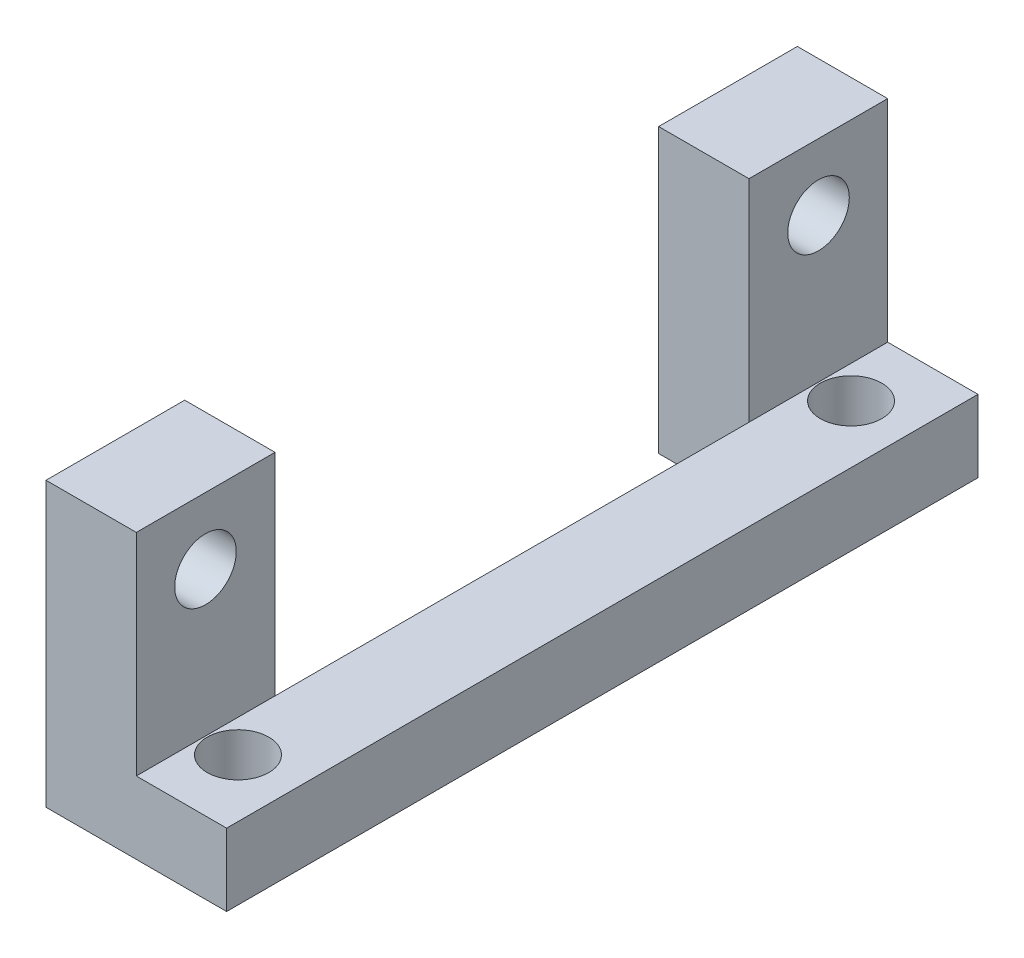
ISO-10303-21;
HEADER;
FILE_DESCRIPTION(('STEP AP214'),'2;1');
FILE_NAME('part.step','',(''),(''),'','','');
FILE_SCHEMA(('AUTOMOTIVE_DESIGN { 1 0 10303 214 1 1 1 1 }'));
ENDSEC;
DATA;
#1=APPLICATION_CONTEXT('core data for automotive mechanical design processes');
#2=APPLICATION_PROTOCOL_DEFINITION('international standard','automotive_design',2000,#1);
#3=PRODUCT_CONTEXT('',#1,'mechanical');
#4=PRODUCT('Part','Part','',(#3));
#5=PRODUCT_RELATED_PRODUCT_CATEGORY('part','',(#4));
#6=PRODUCT_DEFINITION_FORMATION('','',#4);
#7=PRODUCT_DEFINITION_CONTEXT('part definition',#1,'design');
#8=PRODUCT_DEFINITION('design','',#6,#7);
#9=PRODUCT_DEFINITION_SHAPE('','',#8);
#10=(LENGTH_UNIT() NAMED_UNIT(*) SI_UNIT(.MILLI.,.METRE.));
#11=(NAMED_UNIT(*) PLANE_ANGLE_UNIT() SI_UNIT($,.RADIAN.));
#12=(NAMED_UNIT(*) SI_UNIT($,.STERADIAN.) SOLID_ANGLE_UNIT());
#13=UNCERTAINTY_MEASURE_WITH_UNIT(LENGTH_MEASURE(1.E-05),#10,'distance_accuracy_value','');
#14=(GEOMETRIC_REPRESENTATION_CONTEXT(3) GLOBAL_UNCERTAINTY_ASSIGNED_CONTEXT((#13)) GLOBAL_UNIT_ASSIGNED_CONTEXT((#10,
#11,#12)) REPRESENTATION_CONTEXT('',''));
#15=CARTESIAN_POINT('',(0.,0.,0.));
#16=DIRECTION('',(0.,0.,1.));
#17=DIRECTION('',(1.,0.,0.));
#18=AXIS2_PLACEMENT_3D('',#15,#16,#17);
#19=CARTESIAN_POINT('',(0.,0.,16.51));
#20=DIRECTION('',(0.,1.,0.));
#21=DIRECTION('',(0.,0.,1.));
#22=AXIS2_PLACEMENT_3D('',#19,#20,#21);
#23=PLANE('',#22);
#24=DIRECTION('',(0.,0.,1.));
#25=VECTOR('',#24,1.);
#26=CARTESIAN_POINT('',(3.96875,0.,-10.414));
#27=LINE('',#26,#25);
#28=CARTESIAN_POINT('',(3.96875,0.,-10.414));
#29=VERTEX_POINT('',#28);
#30=CARTESIAN_POINT('',(3.96875,0.,10.414));
#31=VERTEX_POINT('',#30);
#32=EDGE_CURVE('E188',#29,#31,#27,.T.);
#33=ORIENTED_EDGE('',*,*,#32,.F.);
#34=DIRECTION('',(1.,0.,0.));
#35=VECTOR('',#34,1.);
#36=CARTESIAN_POINT('',(0.,0.,-10.414));
#37=LINE('',#36,#35);
#38=CARTESIAN_POINT('',(0.,0.,-10.414));
#39=VERTEX_POINT('',#38);
#40=EDGE_CURVE('E185',#39,#29,#37,.T.);
#41=ORIENTED_EDGE('',*,*,#40,.F.);
#42=DIRECTION('',(0.,0.,-1.));
#43=VECTOR('',#42,1.);
#44=CARTESIAN_POINT('',(0.,0.,16.51));
#45=LINE('',#44,#43);
#46=CARTESIAN_POINT('',(0.,0.,-16.51));
#47=VERTEX_POINT('',#46);
#48=EDGE_CURVE('E151',#39,#47,#45,.T.);
#49=ORIENTED_EDGE('',*,*,#48,.T.);
#50=DIRECTION('',(1.,0.,0.));
#51=VECTOR('',#50,1.);
#52=CARTESIAN_POINT('',(0.,0.,-16.51));
#53=LINE('',#52,#51);
#54=CARTESIAN_POINT('',(7.9375,0.,-16.51));
#55=VERTEX_POINT('',#54);
#56=EDGE_CURVE('E136',#47,#55,#53,.T.);
#57=ORIENTED_EDGE('',*,*,#56,.T.);
#58=DIRECTION('',(0.,0.,-1.));
#59=VECTOR('',#58,1.);
#60=CARTESIAN_POINT('',(7.9375,0.,16.51));
#61=LINE('',#60,#59);
#62=CARTESIAN_POINT('',(7.9375,0.,16.51));
#63=VERTEX_POINT('',#62);
#64=EDGE_CURVE('E120',#63,#55,#61,.T.);
#65=ORIENTED_EDGE('',*,*,#64,.F.);
#66=DIRECTION('',(1.,0.,0.));
#67=VECTOR('',#66,1.);
#68=CARTESIAN_POINT('',(0.,0.,16.51));
#69=LINE('',#68,#67);
#70=CARTESIAN_POINT('',(0.,0.,16.51));
#71=VERTEX_POINT('',#70);
#72=EDGE_CURVE('E107',#71,#63,#69,.T.);
#73=ORIENTED_EDGE('',*,*,#72,.F.);
#74=CARTESIAN_POINT('',(0.,0.,10.414));
#75=VERTEX_POINT('',#74);
#76=EDGE_CURVE('E152',#71,#75,#45,.T.);
#77=ORIENTED_EDGE('',*,*,#76,.T.);
#78=DIRECTION('',(-1.,0.,0.));
#79=VECTOR('',#78,1.);
#80=CARTESIAN_POINT('',(0.,0.,10.414));
#81=LINE('',#80,#79);
#82=EDGE_CURVE('E133',#31,#75,#81,.T.);
#83=ORIENTED_EDGE('',*,*,#82,.F.);
#84=EDGE_LOOP('',(#33,#41,#49,#57,#65,#73,#77,#83));
#85=FACE_BOUND('',#84,.T.);
#86=CARTESIAN_POINT('',(5.3975,0.,-13.4703841816037));
#87=DIRECTION('',(0.,-1.,0.));
#88=DIRECTION('',(0.,0.,-1.));
#89=AXIS2_PLACEMENT_3D('',#86,#87,#88);
#90=CIRCLE('',#89,1.35254999999999);
#91=CARTESIAN_POINT('',(5.3975,0.,-14.8229341816037));
#92=VERTEX_POINT('',#91);
#93=EDGE_CURVE('E206',#92,#92,#90,.T.);
#94=ORIENTED_EDGE('',*,*,#93,.F.);
#95=EDGE_LOOP('',(#94));
#96=FACE_BOUND('',#95,.T.);
#97=CARTESIAN_POINT('',(5.3975,0.,13.4703841816037));
#98=DIRECTION('',(0.,-1.,0.));
#99=DIRECTION('',(0.,0.,-1.));
#100=AXIS2_PLACEMENT_3D('',#97,#98,#99);
#101=CIRCLE('',#100,1.35254999999999);
#102=CARTESIAN_POINT('',(5.3975,0.,12.1178341816037));
#103=VERTEX_POINT('',#102);
#104=EDGE_CURVE('E212',#103,#103,#101,.T.);
#105=ORIENTED_EDGE('',*,*,#104,.F.);
#106=EDGE_LOOP('',(#105));
#107=FACE_BOUND('',#106,.T.);
#108=ADVANCED_FACE('F30',(#85,#96,#107),#23,.F.);
#109=CARTESIAN_POINT('',(3.96875,12.446,16.51));
#110=DIRECTION('',(0.,-1.,0.));
#111=DIRECTION('',(0.,0.,-1.));
#112=AXIS2_PLACEMENT_3D('',#109,#110,#111);
#113=PLANE('',#112);
#114=DIRECTION('',(0.,0.,-1.));
#115=VECTOR('',#114,1.);
#116=CARTESIAN_POINT('',(0.,12.446,16.51));
#117=LINE('',#116,#115);
#118=CARTESIAN_POINT('',(0.,12.446,-10.414));
#119=VERTEX_POINT('',#118);
#120=CARTESIAN_POINT('',(0.,12.446,-16.51));
#121=VERTEX_POINT('',#120);
#122=EDGE_CURVE('E155',#119,#121,#117,.T.);
#123=ORIENTED_EDGE('',*,*,#122,.F.);
#124=DIRECTION('',(-1.,0.,0.));
#125=VECTOR('',#124,1.);
#126=CARTESIAN_POINT('',(0.,12.446,-10.414));
#127=LINE('',#126,#125);
#128=CARTESIAN_POINT('',(3.96875,12.446,-10.414));
#129=VERTEX_POINT('',#128);
#130=EDGE_CURVE('E175',#129,#119,#127,.T.);
#131=ORIENTED_EDGE('',*,*,#130,.F.);
#132=DIRECTION('',(0.,0.,-1.));
#133=VECTOR('',#132,1.);
#134=CARTESIAN_POINT('',(3.96875,12.446,16.51));
#135=LINE('',#134,#133);
#136=CARTESIAN_POINT('',(3.96875,12.446,-16.51));
#137=VERTEX_POINT('',#136);
#138=EDGE_CURVE('E82',#129,#137,#135,.T.);
#139=ORIENTED_EDGE('',*,*,#138,.T.);
#140=DIRECTION('',(-1.,0.,0.));
#141=VECTOR('',#140,1.);
#142=CARTESIAN_POINT('',(3.96875,12.446,-16.51));
#143=LINE('',#142,#141);
#144=EDGE_CURVE('E130',#137,#121,#143,.T.);
#145=ORIENTED_EDGE('',*,*,#144,.T.);
#146=EDGE_LOOP('',(#123,#131,#139,#145));
#147=FACE_BOUND('',#146,.T.);
#148=ADVANCED_FACE('F219',(#147),#113,.F.);
#149=CARTESIAN_POINT('',(0.,12.446,16.51));
#150=DIRECTION('',(1.,0.,0.));
#151=DIRECTION('',(0.,1.,0.));
#152=AXIS2_PLACEMENT_3D('',#149,#150,#151);
#153=PLANE('',#152);
#154=CARTESIAN_POINT('',(0.,9.525,-13.4703841816037));
#155=DIRECTION('',(1.,0.,0.));
#156=DIRECTION('',(0.,1.,0.));
#157=AXIS2_PLACEMENT_3D('',#154,#155,#156);
#158=CIRCLE('',#157,1.35254999999999);
#159=CARTESIAN_POINT('',(0.,10.87755,-13.4703841816037));
#160=VERTEX_POINT('',#159);
#161=EDGE_CURVE('E191',#160,#160,#158,.T.);
#162=ORIENTED_EDGE('',*,*,#161,.T.);
#163=EDGE_LOOP('',(#162));
#164=FACE_BOUND('',#163,.T.);
#165=ORIENTED_EDGE('',*,*,#48,.F.);
#166=DIRECTION('',(0.,1.,0.));
#167=VECTOR('',#166,1.);
#168=CARTESIAN_POINT('',(0.,-0.000999999999999265,-10.414));
#169=LINE('',#168,#167);
#170=EDGE_CURVE('E171',#39,#119,#169,.T.);
#171=ORIENTED_EDGE('',*,*,#170,.T.);
#172=ORIENTED_EDGE('',*,*,#122,.T.);
#173=DIRECTION('',(0.,-1.,0.));
#174=VECTOR('',#173,1.);
#175=CARTESIAN_POINT('',(0.,12.446,-16.51));
#176=LINE('',#175,#174);
#177=EDGE_CURVE('E132',#121,#47,#176,.T.);
#178=ORIENTED_EDGE('',*,*,#177,.T.);
#179=EDGE_LOOP('',(#165,#171,#172,#178));
#180=FACE_BOUND('',#179,.T.);
#181=ADVANCED_FACE('F225',(#164,#180),#153,.F.);
#182=CARTESIAN_POINT('',(3.96875,3.175,16.51));
#183=DIRECTION('',(-1.,0.,0.));
#184=DIRECTION('',(0.,0.,1.));
#185=AXIS2_PLACEMENT_3D('',#182,#183,#184);
#186=PLANE('',#185);
#187=CARTESIAN_POINT('',(3.96875,9.525,-13.4703841816037));
#188=DIRECTION('',(1.,0.,0.));
#189=DIRECTION('',(0.,0.,-1.));
#190=AXIS2_PLACEMENT_3D('',#187,#188,#189);
#191=CIRCLE('',#190,1.35254999999999);
#192=CARTESIAN_POINT('',(3.96875,9.525,-14.8229341816037));
#193=VERTEX_POINT('',#192);
#194=EDGE_CURVE('E194',#193,#193,#191,.T.);
#195=ORIENTED_EDGE('',*,*,#194,.F.);
#196=EDGE_LOOP('',(#195));
#197=FACE_BOUND('',#196,.T.);
#198=ORIENTED_EDGE('',*,*,#138,.F.);
#199=DIRECTION('',(0.,-1.,0.));
#200=VECTOR('',#199,1.);
#201=CARTESIAN_POINT('',(3.96875,3.175,-10.414));
#202=LINE('',#201,#200);
#203=CARTESIAN_POINT('',(3.96875,3.175,-10.414));
#204=VERTEX_POINT('',#203);
#205=EDGE_CURVE('E11',#129,#204,#202,.T.);
#206=ORIENTED_EDGE('',*,*,#205,.T.);
#207=DIRECTION('',(0.,0.,-1.));
#208=VECTOR('',#207,1.);
#209=CARTESIAN_POINT('',(3.96875,3.175,16.51));
#210=LINE('',#209,#208);
#211=CARTESIAN_POINT('',(3.96875,3.175,-16.51));
#212=VERTEX_POINT('',#211);
#213=EDGE_CURVE('E147',#204,#212,#210,.T.);
#214=ORIENTED_EDGE('',*,*,#213,.T.);
#215=DIRECTION('',(0.,1.,0.));
#216=VECTOR('',#215,1.);
#217=CARTESIAN_POINT('',(3.96875,3.175,-16.51));
#218=LINE('',#217,#216);
#219=EDGE_CURVE('E141',#212,#137,#218,.T.);
#220=ORIENTED_EDGE('',*,*,#219,.T.);
#221=EDGE_LOOP('',(#198,#206,#214,#220));
#222=FACE_BOUND('',#221,.T.);
#223=ADVANCED_FACE('F237',(#197,#222),#186,.F.);
#224=CARTESIAN_POINT('',(3.96875,12.446,16.51));
#225=VERTEX_POINT('',#224);
#226=CARTESIAN_POINT('',(3.96875,12.446,10.414));
#227=VERTEX_POINT('',#226);
#228=EDGE_CURVE('E144',#225,#227,#135,.T.);
#229=ORIENTED_EDGE('',*,*,#228,.T.);
#230=DIRECTION('',(1.,0.,0.));
#231=VECTOR('',#230,1.);
#232=CARTESIAN_POINT('',(0.,12.446,10.414));
#233=LINE('',#232,#231);
#234=CARTESIAN_POINT('',(0.,12.446,10.414));
#235=VERTEX_POINT('',#234);
#236=EDGE_CURVE('E45',#235,#227,#233,.T.);
#237=ORIENTED_EDGE('',*,*,#236,.F.);
#238=CARTESIAN_POINT('',(0.,12.446,16.51));
#239=VERTEX_POINT('',#238);
#240=EDGE_CURVE('E156',#239,#235,#117,.T.);
#241=ORIENTED_EDGE('',*,*,#240,.F.);
#242=DIRECTION('',(-1.,0.,0.));
#243=VECTOR('',#242,1.);
#244=CARTESIAN_POINT('',(3.96875,12.446,16.51));
#245=LINE('',#244,#243);
#246=EDGE_CURVE('E143',#225,#239,#245,.T.);
#247=ORIENTED_EDGE('',*,*,#246,.F.);
#248=EDGE_LOOP('',(#229,#237,#241,#247));
#249=FACE_BOUND('',#248,.T.);
#250=ADVANCED_FACE('F32',(#249),#113,.F.);
#251=CARTESIAN_POINT('',(0.,9.525,13.4703841816037));
#252=DIRECTION('',(1.,0.,0.));
#253=DIRECTION('',(0.,1.,0.));
#254=AXIS2_PLACEMENT_3D('',#251,#252,#253);
#255=CIRCLE('',#254,1.35254999999999);
#256=CARTESIAN_POINT('',(0.,10.87755,13.4703841816037));
#257=VERTEX_POINT('',#256);
#258=EDGE_CURVE('E197',#257,#257,#255,.T.);
#259=ORIENTED_EDGE('',*,*,#258,.T.);
#260=EDGE_LOOP('',(#259));
#261=FACE_BOUND('',#260,.T.);
#262=ORIENTED_EDGE('',*,*,#240,.T.);
#263=DIRECTION('',(0.,1.,0.));
#264=VECTOR('',#263,1.);
#265=CARTESIAN_POINT('',(0.,-0.000999999999999265,10.414));
#266=LINE('',#265,#264);
#267=EDGE_CURVE('E172',#75,#235,#266,.T.);
#268=ORIENTED_EDGE('',*,*,#267,.F.);
#269=ORIENTED_EDGE('',*,*,#76,.F.);
#270=DIRECTION('',(0.,-1.,0.));
#271=VECTOR('',#270,1.);
#272=CARTESIAN_POINT('',(0.,12.446,16.51));
#273=LINE('',#272,#271);
#274=EDGE_CURVE('E91',#239,#71,#273,.T.);
#275=ORIENTED_EDGE('',*,*,#274,.F.);
#276=EDGE_LOOP('',(#262,#268,#269,#275));
#277=FACE_BOUND('',#276,.T.);
#278=ADVANCED_FACE('F230',(#261,#277),#153,.F.);
#279=CARTESIAN_POINT('',(7.9375,0.,16.51));
#280=DIRECTION('',(-1.,0.,0.));
#281=DIRECTION('',(0.,0.,1.));
#282=AXIS2_PLACEMENT_3D('',#279,#280,#281);
#283=PLANE('',#282);
#284=DIRECTION('',(0.,1.,0.));
#285=VECTOR('',#284,1.);
#286=CARTESIAN_POINT('',(7.9375,0.,-16.51));
#287=LINE('',#286,#285);
#288=CARTESIAN_POINT('',(7.9375,3.175,-16.51));
#289=VERTEX_POINT('',#288);
#290=EDGE_CURVE('E116',#55,#289,#287,.T.);
#291=ORIENTED_EDGE('',*,*,#290,.T.);
#292=DIRECTION('',(0.,0.,-1.));
#293=VECTOR('',#292,1.);
#294=CARTESIAN_POINT('',(7.9375,3.175,16.51));
#295=LINE('',#294,#293);
#296=CARTESIAN_POINT('',(7.9375,3.175,16.51));
#297=VERTEX_POINT('',#296);
#298=EDGE_CURVE('E113',#297,#289,#295,.T.);
#299=ORIENTED_EDGE('',*,*,#298,.F.);
#300=DIRECTION('',(0.,1.,0.));
#301=VECTOR('',#300,1.);
#302=CARTESIAN_POINT('',(7.9375,0.,16.51));
#303=LINE('',#302,#301);
#304=EDGE_CURVE('E100',#63,#297,#303,.T.);
#305=ORIENTED_EDGE('',*,*,#304,.F.);
#306=ORIENTED_EDGE('',*,*,#64,.T.);
#307=EDGE_LOOP('',(#291,#299,#305,#306));
#308=FACE_BOUND('',#307,.T.);
#309=ADVANCED_FACE('F114',(#308),#283,.F.);
#310=CARTESIAN_POINT('',(7.9375,3.175,16.51));
#311=DIRECTION('',(0.,-1.,0.));
#312=DIRECTION('',(1.,0.,0.));
#313=AXIS2_PLACEMENT_3D('',#310,#311,#312);
#314=PLANE('',#313);
#315=CARTESIAN_POINT('',(5.3975,3.175,13.4703841816037));
#316=DIRECTION('',(0.,-1.,0.));
#317=DIRECTION('',(1.,0.,0.));
#318=AXIS2_PLACEMENT_3D('',#315,#316,#317);
#319=CIRCLE('',#318,1.35254999999999);
#320=CARTESIAN_POINT('',(6.75004999999999,3.175,13.4703841816037));
#321=VERTEX_POINT('',#320);
#322=EDGE_CURVE('E209',#321,#321,#319,.T.);
#323=ORIENTED_EDGE('',*,*,#322,.T.);
#324=EDGE_LOOP('',(#323));
#325=FACE_BOUND('',#324,.T.);
#326=CARTESIAN_POINT('',(5.3975,3.175,-13.4703841816037));
#327=DIRECTION('',(0.,-1.,0.));
#328=DIRECTION('',(1.,0.,0.));
#329=AXIS2_PLACEMENT_3D('',#326,#327,#328);
#330=CIRCLE('',#329,1.35254999999999);
#331=CARTESIAN_POINT('',(6.75004999999999,3.175,-13.4703841816037));
#332=VERTEX_POINT('',#331);
#333=EDGE_CURVE('E203',#332,#332,#330,.T.);
#334=ORIENTED_EDGE('',*,*,#333,.T.);
#335=EDGE_LOOP('',(#334));
#336=FACE_BOUND('',#335,.T.);
#337=DIRECTION('',(-1.,0.,0.));
#338=VECTOR('',#337,1.);
#339=CARTESIAN_POINT('',(7.9375,3.175,-16.51));
#340=LINE('',#339,#338);
#341=EDGE_CURVE('E139',#289,#212,#340,.T.);
#342=ORIENTED_EDGE('',*,*,#341,.T.);
#343=ORIENTED_EDGE('',*,*,#213,.F.);
#344=CARTESIAN_POINT('',(3.96875,3.175,10.414));
#345=VERTEX_POINT('',#344);
#346=EDGE_CURVE('E148',#345,#204,#210,.T.);
#347=ORIENTED_EDGE('',*,*,#346,.F.);
#348=CARTESIAN_POINT('',(3.96875,3.175,16.51));
#349=VERTEX_POINT('',#348);
#350=EDGE_CURVE('E121',#349,#345,#210,.T.);
#351=ORIENTED_EDGE('',*,*,#350,.F.);
#352=DIRECTION('',(-1.,0.,0.));
#353=VECTOR('',#352,1.);
#354=CARTESIAN_POINT('',(7.9375,3.175,16.51));
#355=LINE('',#354,#353);
#356=EDGE_CURVE('E104',#297,#349,#355,.T.);
#357=ORIENTED_EDGE('',*,*,#356,.F.);
#358=ORIENTED_EDGE('',*,*,#298,.T.);
#359=EDGE_LOOP('',(#342,#343,#347,#351,#357,#358));
#360=FACE_BOUND('',#359,.T.);
#361=ADVANCED_FACE('F123',(#325,#336,#360),#314,.F.);
#362=CARTESIAN_POINT('',(3.96875,9.525,13.4703841816037));
#363=DIRECTION('',(1.,0.,0.));
#364=DIRECTION('',(0.,0.,-1.));
#365=AXIS2_PLACEMENT_3D('',#362,#363,#364);
#366=CIRCLE('',#365,1.35254999999999);
#367=CARTESIAN_POINT('',(3.96875,9.525,12.1178341816037));
#368=VERTEX_POINT('',#367);
#369=EDGE_CURVE('E200',#368,#368,#366,.T.);
#370=ORIENTED_EDGE('',*,*,#369,.F.);
#371=EDGE_LOOP('',(#370));
#372=FACE_BOUND('',#371,.T.);
#373=ORIENTED_EDGE('',*,*,#350,.T.);
#374=DIRECTION('',(0.,1.,0.));
#375=VECTOR('',#374,1.);
#376=CARTESIAN_POINT('',(3.96875,3.175,10.414));
#377=LINE('',#376,#375);
#378=EDGE_CURVE('E38',#345,#227,#377,.T.);
#379=ORIENTED_EDGE('',*,*,#378,.T.);
#380=ORIENTED_EDGE('',*,*,#228,.F.);
#381=DIRECTION('',(0.,1.,0.));
#382=VECTOR('',#381,1.);
#383=CARTESIAN_POINT('',(3.96875,3.175,16.51));
#384=LINE('',#383,#382);
#385=EDGE_CURVE('E54',#349,#225,#384,.T.);
#386=ORIENTED_EDGE('',*,*,#385,.F.);
#387=EDGE_LOOP('',(#373,#379,#380,#386));
#388=FACE_BOUND('',#387,.T.);
#389=ADVANCED_FACE('F158',(#372,#388),#186,.F.);
#390=CARTESIAN_POINT('',(0.,12.446,16.51));
#391=DIRECTION('',(0.,0.,1.));
#392=DIRECTION('',(1.,0.,0.));
#393=AXIS2_PLACEMENT_3D('',#390,#391,#392);
#394=PLANE('',#393);
#395=ORIENTED_EDGE('',*,*,#246,.T.);
#396=ORIENTED_EDGE('',*,*,#274,.T.);
#397=ORIENTED_EDGE('',*,*,#72,.T.);
#398=ORIENTED_EDGE('',*,*,#304,.T.);
#399=ORIENTED_EDGE('',*,*,#356,.T.);
#400=ORIENTED_EDGE('',*,*,#385,.T.);
#401=EDGE_LOOP('',(#395,#396,#397,#398,#399,#400));
#402=FACE_BOUND('',#401,.T.);
#403=ADVANCED_FACE('F102',(#402),#394,.T.);
#404=CARTESIAN_POINT('',(0.,12.446,-16.51));
#405=DIRECTION('',(0.,0.,1.));
#406=DIRECTION('',(1.,0.,0.));
#407=AXIS2_PLACEMENT_3D('',#404,#405,#406);
#408=PLANE('',#407);
#409=ORIENTED_EDGE('',*,*,#144,.F.);
#410=ORIENTED_EDGE('',*,*,#219,.F.);
#411=ORIENTED_EDGE('',*,*,#341,.F.);
#412=ORIENTED_EDGE('',*,*,#290,.F.);
#413=ORIENTED_EDGE('',*,*,#56,.F.);
#414=ORIENTED_EDGE('',*,*,#177,.F.);
#415=EDGE_LOOP('',(#409,#410,#411,#412,#413,#414));
#416=FACE_BOUND('',#415,.T.);
#417=ADVANCED_FACE('F274',(#416),#408,.F.);
#418=CARTESIAN_POINT('',(3.96875,-0.000999999999999265,-10.414));
#419=DIRECTION('',(1.,0.,0.));
#420=DIRECTION('',(0.,0.,-1.));
#421=AXIS2_PLACEMENT_3D('',#418,#419,#420);
#422=PLANE('',#421);
#423=DIRECTION('',(0.,1.,0.));
#424=VECTOR('',#423,1.);
#425=CARTESIAN_POINT('',(3.96875,-0.000999999999999265,-10.414));
#426=LINE('',#425,#424);
#427=EDGE_CURVE('E177',#29,#204,#426,.T.);
#428=ORIENTED_EDGE('',*,*,#427,.F.);
#429=ORIENTED_EDGE('',*,*,#32,.T.);
#430=DIRECTION('',(0.,1.,0.));
#431=VECTOR('',#430,1.);
#432=CARTESIAN_POINT('',(3.96875,-0.000999999999999265,10.414));
#433=LINE('',#432,#431);
#434=EDGE_CURVE('E174',#31,#345,#433,.T.);
#435=ORIENTED_EDGE('',*,*,#434,.T.);
#436=ORIENTED_EDGE('',*,*,#346,.T.);
#437=EDGE_LOOP('',(#428,#429,#435,#436));
#438=FACE_BOUND('',#437,.T.);
#439=ADVANCED_FACE('F268',(#438),#422,.F.);
#440=CARTESIAN_POINT('',(0.,-0.000999999999999265,-10.414));
#441=DIRECTION('',(0.,0.,-1.));
#442=DIRECTION('',(-1.,0.,0.));
#443=AXIS2_PLACEMENT_3D('',#440,#441,#442);
#444=PLANE('',#443);
#445=ORIENTED_EDGE('',*,*,#40,.T.);
#446=ORIENTED_EDGE('',*,*,#427,.T.);
#447=ORIENTED_EDGE('',*,*,#205,.F.);
#448=ORIENTED_EDGE('',*,*,#130,.T.);
#449=ORIENTED_EDGE('',*,*,#170,.F.);
#450=EDGE_LOOP('',(#445,#446,#447,#448,#449));
#451=FACE_BOUND('',#450,.T.);
#452=ADVANCED_FACE('F259',(#451),#444,.F.);
#453=CARTESIAN_POINT('',(0.,-0.000999999999999265,10.414));
#454=DIRECTION('',(0.,0.,1.));
#455=DIRECTION('',(1.,0.,0.));
#456=AXIS2_PLACEMENT_3D('',#453,#454,#455);
#457=PLANE('',#456);
#458=ORIENTED_EDGE('',*,*,#82,.T.);
#459=ORIENTED_EDGE('',*,*,#267,.T.);
#460=ORIENTED_EDGE('',*,*,#236,.T.);
#461=ORIENTED_EDGE('',*,*,#378,.F.);
#462=ORIENTED_EDGE('',*,*,#434,.F.);
#463=EDGE_LOOP('',(#458,#459,#460,#461,#462));
#464=FACE_BOUND('',#463,.T.);
#465=ADVANCED_FACE('F281',(#464),#457,.F.);
#466=CARTESIAN_POINT('',(3.96875,9.525,-13.4703841816037));
#467=DIRECTION('',(1.,0.,0.));
#468=DIRECTION('',(0.,0.,-1.));
#469=AXIS2_PLACEMENT_3D('',#466,#467,#468);
#470=CYLINDRICAL_SURFACE('',#469,1.35254999999999);
#471=ORIENTED_EDGE('',*,*,#161,.F.);
#472=EDGE_LOOP('',(#471));
#473=FACE_BOUND('',#472,.T.);
#474=ORIENTED_EDGE('',*,*,#194,.T.);
#475=EDGE_LOOP('',(#474));
#476=FACE_BOUND('',#475,.T.);
#477=ADVANCED_FACE('F283',(#473,#476),#470,.F.);
#478=CARTESIAN_POINT('',(3.96875,9.525,13.4703841816037));
#479=DIRECTION('',(1.,0.,0.));
#480=DIRECTION('',(0.,0.,-1.));
#481=AXIS2_PLACEMENT_3D('',#478,#479,#480);
#482=CYLINDRICAL_SURFACE('',#481,1.35254999999999);
#483=ORIENTED_EDGE('',*,*,#258,.F.);
#484=EDGE_LOOP('',(#483));
#485=FACE_BOUND('',#484,.T.);
#486=ORIENTED_EDGE('',*,*,#369,.T.);
#487=EDGE_LOOP('',(#486));
#488=FACE_BOUND('',#487,.T.);
#489=ADVANCED_FACE('F289',(#485,#488),#482,.F.);
#490=CARTESIAN_POINT('',(5.3975,0.,-13.4703841816037));
#491=DIRECTION('',(0.,-1.,0.));
#492=DIRECTION('',(0.,0.,-1.));
#493=AXIS2_PLACEMENT_3D('',#490,#491,#492);
#494=CYLINDRICAL_SURFACE('',#493,1.35254999999999);
#495=ORIENTED_EDGE('',*,*,#333,.F.);
#496=EDGE_LOOP('',(#495));
#497=FACE_BOUND('',#496,.T.);
#498=ORIENTED_EDGE('',*,*,#93,.T.);
#499=EDGE_LOOP('',(#498));
#500=FACE_BOUND('',#499,.T.);
#501=ADVANCED_FACE('F308',(#497,#500),#494,.F.);
#502=CARTESIAN_POINT('',(5.3975,0.,13.4703841816037));
#503=DIRECTION('',(0.,-1.,0.));
#504=DIRECTION('',(0.,0.,-1.));
#505=AXIS2_PLACEMENT_3D('',#502,#503,#504);
#506=CYLINDRICAL_SURFACE('',#505,1.35254999999999);
#507=ORIENTED_EDGE('',*,*,#322,.F.);
#508=EDGE_LOOP('',(#507));
#509=FACE_BOUND('',#508,.T.);
#510=ORIENTED_EDGE('',*,*,#104,.T.);
#511=EDGE_LOOP('',(#510));
#512=FACE_BOUND('',#511,.T.);
#513=ADVANCED_FACE('F216',(#509,#512),#506,.F.);
#514=CLOSED_SHELL('',(#108,#148,#181,#223,#250,#278,#309,#361,#389,#403,#417,#439,#452,#465,
#477,#489,#501,#513));
#515=MANIFOLD_SOLID_BREP('B2',#514);
#516=ADVANCED_BREP_SHAPE_REPRESENTATION('',(#18,#515),#14);
#517=SHAPE_DEFINITION_REPRESENTATION(#9,#516);
ENDSEC;
END-ISO-10303-21;
